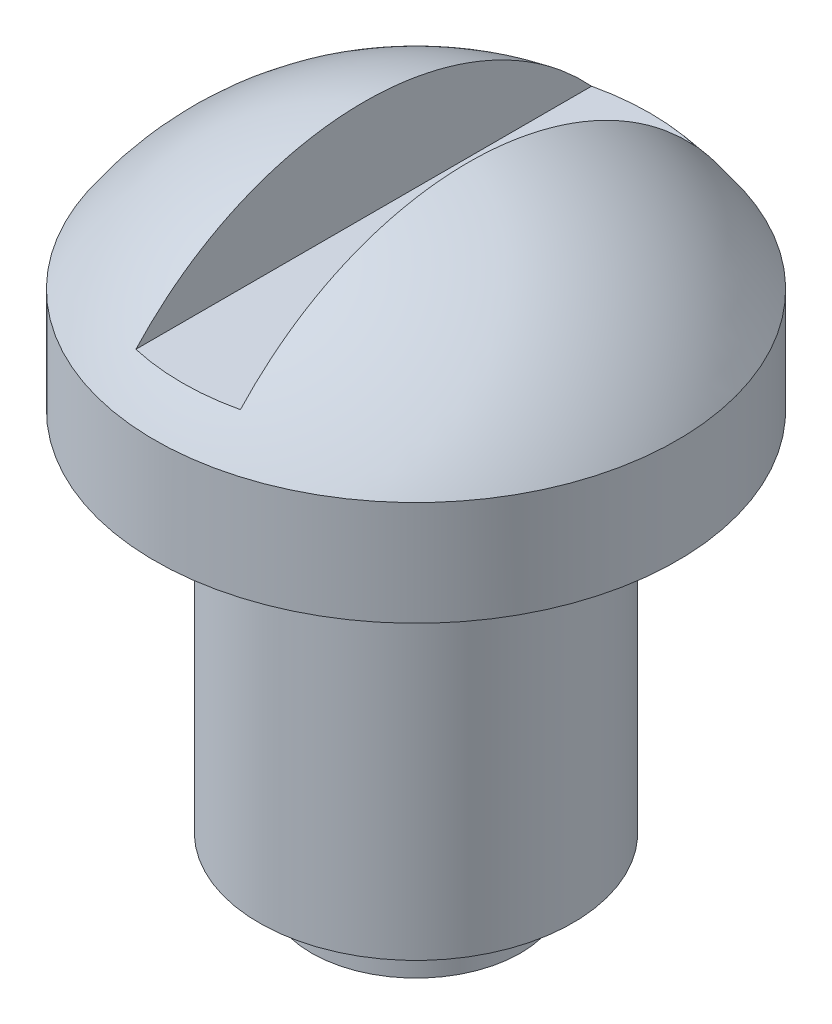
ISO-10303-21;
HEADER;
FILE_DESCRIPTION(('STEP AP214'),'2;1');
FILE_NAME('part.step','',(''),(''),'','','');
FILE_SCHEMA(('AUTOMOTIVE_DESIGN { 1 0 10303 214 1 1 1 1 }'));
ENDSEC;
DATA;
#1=APPLICATION_CONTEXT('core data for automotive mechanical design processes');
#2=APPLICATION_PROTOCOL_DEFINITION('international standard','automotive_design',2000,#1);
#3=PRODUCT_CONTEXT('',#1,'mechanical');
#4=PRODUCT('Part','Part','',(#3));
#5=PRODUCT_RELATED_PRODUCT_CATEGORY('part','',(#4));
#6=PRODUCT_DEFINITION_FORMATION('','',#4);
#7=PRODUCT_DEFINITION_CONTEXT('part definition',#1,'design');
#8=PRODUCT_DEFINITION('design','',#6,#7);
#9=PRODUCT_DEFINITION_SHAPE('','',#8);
#10=(LENGTH_UNIT() NAMED_UNIT(*) SI_UNIT(.MILLI.,.METRE.));
#11=(NAMED_UNIT(*) PLANE_ANGLE_UNIT() SI_UNIT($,.RADIAN.));
#12=(NAMED_UNIT(*) SI_UNIT($,.STERADIAN.) SOLID_ANGLE_UNIT());
#13=UNCERTAINTY_MEASURE_WITH_UNIT(LENGTH_MEASURE(1.E-05),#10,'distance_accuracy_value','');
#14=(GEOMETRIC_REPRESENTATION_CONTEXT(3) GLOBAL_UNCERTAINTY_ASSIGNED_CONTEXT((#13)) GLOBAL_UNIT_ASSIGNED_CONTEXT((#10,
#11,#12)) REPRESENTATION_CONTEXT('',''));
#15=CARTESIAN_POINT('',(0.,0.,0.));
#16=DIRECTION('',(0.,0.,1.));
#17=DIRECTION('',(1.,0.,0.));
#18=AXIS2_PLACEMENT_3D('',#15,#16,#17);
#19=CARTESIAN_POINT('',(3.,8.,0.));
#20=DIRECTION('',(0.,1.,0.));
#21=DIRECTION('',(-1.,0.,0.));
#22=AXIS2_PLACEMENT_3D('',#19,#20,#21);
#23=PLANE('',#22);
#24=CARTESIAN_POINT('',(0.,8.,0.));
#25=DIRECTION('',(0.,1.,0.));
#26=DIRECTION('',(-1.,0.,0.));
#27=AXIS2_PLACEMENT_3D('',#24,#25,#26);
#28=CIRCLE('',#27,5.);
#29=CARTESIAN_POINT('',(-5.,8.,0.));
#30=VERTEX_POINT('',#29);
#31=EDGE_CURVE('E72',#30,#30,#28,.T.);
#32=ORIENTED_EDGE('',*,*,#31,.F.);
#33=EDGE_LOOP('',(#32));
#34=FACE_BOUND('',#33,.T.);
#35=CARTESIAN_POINT('',(0.,8.,0.));
#36=DIRECTION('',(0.,1.,0.));
#37=DIRECTION('',(-1.,0.,0.));
#38=AXIS2_PLACEMENT_3D('',#35,#36,#37);
#39=CIRCLE('',#38,3.);
#40=CARTESIAN_POINT('',(-3.,8.,0.));
#41=VERTEX_POINT('',#40);
#42=EDGE_CURVE('E76',#41,#41,#39,.T.);
#43=ORIENTED_EDGE('',*,*,#42,.T.);
#44=EDGE_LOOP('',(#43));
#45=FACE_BOUND('',#44,.T.);
#46=ADVANCED_FACE('F37',(#34,#45),#23,.F.);
#47=CARTESIAN_POINT('',(0.,15.2489212052531,0.));
#48=DIRECTION('',(0.,1.,0.));
#49=DIRECTION('',(-1.,0.,0.));
#50=AXIS2_PLACEMENT_3D('',#47,#48,#49);
#51=CYLINDRICAL_SURFACE('',#50,3.);
#52=ORIENTED_EDGE('',*,*,#42,.F.);
#53=EDGE_LOOP('',(#52));
#54=FACE_BOUND('',#53,.T.);
#55=CARTESIAN_POINT('',(0.,1.,0.));
#56=DIRECTION('',(0.,1.,0.));
#57=DIRECTION('',(-1.,0.,0.));
#58=AXIS2_PLACEMENT_3D('',#55,#56,#57);
#59=CIRCLE('',#58,3.);
#60=CARTESIAN_POINT('',(-3.,1.,0.));
#61=VERTEX_POINT('',#60);
#62=EDGE_CURVE('E80',#61,#61,#59,.T.);
#63=ORIENTED_EDGE('',*,*,#62,.T.);
#64=EDGE_LOOP('',(#63));
#65=FACE_BOUND('',#64,.T.);
#66=ADVANCED_FACE('F100',(#54,#65),#51,.T.);
#67=CARTESIAN_POINT('',(2.,1.,0.));
#68=DIRECTION('',(0.,1.,0.));
#69=DIRECTION('',(-1.,0.,0.));
#70=AXIS2_PLACEMENT_3D('',#67,#68,#69);
#71=PLANE('',#70);
#72=ORIENTED_EDGE('',*,*,#62,.F.);
#73=EDGE_LOOP('',(#72));
#74=FACE_BOUND('',#73,.T.);
#75=CARTESIAN_POINT('',(0.,1.,0.));
#76=DIRECTION('',(0.,1.,0.));
#77=DIRECTION('',(-1.,0.,0.));
#78=AXIS2_PLACEMENT_3D('',#75,#76,#77);
#79=CIRCLE('',#78,2.);
#80=CARTESIAN_POINT('',(-2.,1.,0.));
#81=VERTEX_POINT('',#80);
#82=EDGE_CURVE('E83',#81,#81,#79,.T.);
#83=ORIENTED_EDGE('',*,*,#82,.T.);
#84=EDGE_LOOP('',(#83));
#85=FACE_BOUND('',#84,.T.);
#86=ADVANCED_FACE('F105',(#74,#85),#71,.F.);
#87=CARTESIAN_POINT('',(0.,15.2489212052531,0.));
#88=DIRECTION('',(0.,1.,0.));
#89=DIRECTION('',(-1.,0.,0.));
#90=AXIS2_PLACEMENT_3D('',#87,#88,#89);
#91=CYLINDRICAL_SURFACE('',#90,2.);
#92=ORIENTED_EDGE('',*,*,#82,.F.);
#93=EDGE_LOOP('',(#92));
#94=FACE_BOUND('',#93,.T.);
#95=CARTESIAN_POINT('',(0.,0.,0.));
#96=DIRECTION('',(0.,1.,0.));
#97=DIRECTION('',(-1.,0.,0.));
#98=AXIS2_PLACEMENT_3D('',#95,#96,#97);
#99=CIRCLE('',#98,2.);
#100=CARTESIAN_POINT('',(-2.,0.,0.));
#101=VERTEX_POINT('',#100);
#102=EDGE_CURVE('E86',#101,#101,#99,.T.);
#103=ORIENTED_EDGE('',*,*,#102,.T.);
#104=EDGE_LOOP('',(#103));
#105=FACE_BOUND('',#104,.T.);
#106=ADVANCED_FACE('F110',(#94,#105),#91,.T.);
#107=CARTESIAN_POINT('',(0.,0.,0.));
#108=DIRECTION('',(0.,1.,0.));
#109=DIRECTION('',(-1.,0.,0.));
#110=AXIS2_PLACEMENT_3D('',#107,#108,#109);
#111=PLANE('',#110);
#112=ORIENTED_EDGE('',*,*,#102,.F.);
#113=EDGE_LOOP('',(#112));
#114=FACE_BOUND('',#113,.T.);
#115=ADVANCED_FACE('F116',(#114),#111,.F.);
#116=CARTESIAN_POINT('',(0.,6.68337520964461,0.));
#117=DIRECTION('',(0.,1.,0.));
#118=DIRECTION('',(1.,0.,0.));
#119=AXIS2_PLACEMENT_3D('',#116,#117,#118);
#120=SPHERICAL_SURFACE('',#119,6.);
#121=CARTESIAN_POINT('',(0.999999999999999,6.68337520964461,0.));
#122=DIRECTION('',(1.,0.,0.));
#123=DIRECTION('',(0.,1.,0.));
#124=AXIS2_PLACEMENT_3D('',#121,#122,#123);
#125=CIRCLE('',#124,5.91607978309962);
#126=CARTESIAN_POINT('',(1.,10.6833752096446,-4.35889894354067));
#127=VERTEX_POINT('',#126);
#128=CARTESIAN_POINT('',(1.,10.6833752096446,4.35889894354067));
#129=VERTEX_POINT('',#128);
#130=EDGE_CURVE('E70',#127,#129,#125,.T.);
#131=ORIENTED_EDGE('',*,*,#130,.T.);
#132=CARTESIAN_POINT('',(0.,10.6833752096446,0.));
#133=DIRECTION('',(0.,-1.,0.));
#134=DIRECTION('',(0.,0.,-1.));
#135=AXIS2_PLACEMENT_3D('',#132,#133,#134);
#136=CIRCLE('',#135,4.47213595499958);
#137=CARTESIAN_POINT('',(-1.,10.6833752096446,4.35889894354067));
#138=VERTEX_POINT('',#137);
#139=EDGE_CURVE('E11',#129,#138,#136,.T.);
#140=ORIENTED_EDGE('',*,*,#139,.T.);
#141=CARTESIAN_POINT('',(-0.999999999999999,6.68337520964461,0.));
#142=DIRECTION('',(-1.,0.,0.));
#143=DIRECTION('',(0.,-1.,0.));
#144=AXIS2_PLACEMENT_3D('',#141,#142,#143);
#145=CIRCLE('',#144,5.91607978309962);
#146=CARTESIAN_POINT('',(-1.,10.6833752096446,-4.35889894354067));
#147=VERTEX_POINT('',#146);
#148=EDGE_CURVE('E40',#138,#147,#145,.T.);
#149=ORIENTED_EDGE('',*,*,#148,.T.);
#150=EDGE_CURVE('E46',#147,#127,#136,.T.);
#151=ORIENTED_EDGE('',*,*,#150,.T.);
#152=EDGE_LOOP('',(#131,#140,#149,#151));
#153=FACE_BOUND('',#152,.T.);
#154=CARTESIAN_POINT('',(0.,10.,0.));
#155=DIRECTION('',(0.,1.,0.));
#156=DIRECTION('',(-1.,0.,0.));
#157=AXIS2_PLACEMENT_3D('',#154,#155,#156);
#158=CIRCLE('',#157,5.00000000000001);
#159=CARTESIAN_POINT('',(-5.,10.,0.));
#160=VERTEX_POINT('',#159);
#161=EDGE_CURVE('E89',#160,#160,#158,.T.);
#162=ORIENTED_EDGE('',*,*,#161,.T.);
#163=EDGE_LOOP('',(#162));
#164=FACE_BOUND('',#163,.T.);
#165=ADVANCED_FACE('F74',(#153,#164),#120,.T.);
#166=CARTESIAN_POINT('',(0.,15.2489212052531,0.));
#167=DIRECTION('',(0.,1.,0.));
#168=DIRECTION('',(-1.,0.,0.));
#169=AXIS2_PLACEMENT_3D('',#166,#167,#168);
#170=CYLINDRICAL_SURFACE('',#169,5.);
#171=ORIENTED_EDGE('',*,*,#161,.F.);
#172=EDGE_LOOP('',(#171));
#173=FACE_BOUND('',#172,.T.);
#174=ORIENTED_EDGE('',*,*,#31,.T.);
#175=EDGE_LOOP('',(#174));
#176=FACE_BOUND('',#175,.T.);
#177=ADVANCED_FACE('F96',(#173,#176),#170,.T.);
#178=CARTESIAN_POINT('',(-1.,13.6833752096446,-5.00000000000001));
#179=DIRECTION('',(-1.,0.,0.));
#180=DIRECTION('',(0.,-1.,0.));
#181=AXIS2_PLACEMENT_3D('',#178,#179,#180);
#182=PLANE('',#181);
#183=DIRECTION('',(0.,0.,1.));
#184=VECTOR('',#183,1.);
#185=CARTESIAN_POINT('',(-1.,10.6833752096446,-5.00000000000001));
#186=LINE('',#185,#184);
#187=EDGE_CURVE('E65',#147,#138,#186,.T.);
#188=ORIENTED_EDGE('',*,*,#187,.F.);
#189=ORIENTED_EDGE('',*,*,#148,.F.);
#190=EDGE_LOOP('',(#188,#189));
#191=FACE_BOUND('',#190,.T.);
#192=ADVANCED_FACE('F129',(#191),#182,.F.);
#193=CARTESIAN_POINT('',(1.,13.6833752096446,-5.00000000000001));
#194=DIRECTION('',(1.,0.,0.));
#195=DIRECTION('',(0.,1.,0.));
#196=AXIS2_PLACEMENT_3D('',#193,#194,#195);
#197=PLANE('',#196);
#198=DIRECTION('',(0.,0.,1.));
#199=VECTOR('',#198,1.);
#200=CARTESIAN_POINT('',(1.,10.6833752096446,-5.00000000000001));
#201=LINE('',#200,#199);
#202=EDGE_CURVE('E53',#127,#129,#201,.T.);
#203=ORIENTED_EDGE('',*,*,#202,.T.);
#204=ORIENTED_EDGE('',*,*,#130,.F.);
#205=EDGE_LOOP('',(#203,#204));
#206=FACE_BOUND('',#205,.T.);
#207=ADVANCED_FACE('F69',(#206),#197,.F.);
#208=CARTESIAN_POINT('',(-1.,10.6833752096446,-5.00000000000001));
#209=DIRECTION('',(0.,-1.,0.));
#210=DIRECTION('',(0.,0.,-1.));
#211=AXIS2_PLACEMENT_3D('',#208,#209,#210);
#212=PLANE('',#211);
#213=ORIENTED_EDGE('',*,*,#202,.F.);
#214=ORIENTED_EDGE('',*,*,#150,.F.);
#215=ORIENTED_EDGE('',*,*,#187,.T.);
#216=ORIENTED_EDGE('',*,*,#139,.F.);
#217=EDGE_LOOP('',(#213,#214,#215,#216));
#218=FACE_BOUND('',#217,.T.);
#219=ADVANCED_FACE('F64',(#218),#212,.F.);
#220=CLOSED_SHELL('',(#46,#66,#86,#106,#115,#165,#177,#192,#207,#219));
#221=MANIFOLD_SOLID_BREP('B2',#220);
#222=ADVANCED_BREP_SHAPE_REPRESENTATION('',(#18,#221),#14);
#223=SHAPE_DEFINITION_REPRESENTATION(#9,#222);
ENDSEC;
END-ISO-10303-21;
